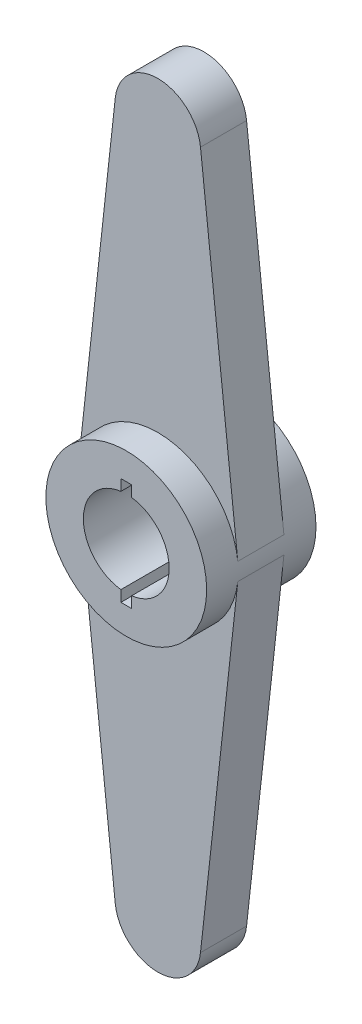
ISO-10303-21;
HEADER;
FILE_DESCRIPTION(('STEP AP214'),'2;1');
FILE_NAME('part.step','',(''),(''),'','','');
FILE_SCHEMA(('AUTOMOTIVE_DESIGN { 1 0 10303 214 1 1 1 1 }'));
ENDSEC;
DATA;
#1=APPLICATION_CONTEXT('core data for automotive mechanical design processes');
#2=APPLICATION_PROTOCOL_DEFINITION('international standard','automotive_design',2000,#1);
#3=PRODUCT_CONTEXT('',#1,'mechanical');
#4=PRODUCT('Part','Part','',(#3));
#5=PRODUCT_RELATED_PRODUCT_CATEGORY('part','',(#4));
#6=PRODUCT_DEFINITION_FORMATION('','',#4);
#7=PRODUCT_DEFINITION_CONTEXT('part definition',#1,'design');
#8=PRODUCT_DEFINITION('design','',#6,#7);
#9=PRODUCT_DEFINITION_SHAPE('','',#8);
#10=(LENGTH_UNIT() NAMED_UNIT(*) SI_UNIT(.MILLI.,.METRE.));
#11=(NAMED_UNIT(*) PLANE_ANGLE_UNIT() SI_UNIT($,.RADIAN.));
#12=(NAMED_UNIT(*) SI_UNIT($,.STERADIAN.) SOLID_ANGLE_UNIT());
#13=UNCERTAINTY_MEASURE_WITH_UNIT(LENGTH_MEASURE(1.E-05),#10,'distance_accuracy_value','');
#14=(GEOMETRIC_REPRESENTATION_CONTEXT(3) GLOBAL_UNCERTAINTY_ASSIGNED_CONTEXT((#13)) GLOBAL_UNIT_ASSIGNED_CONTEXT((#10,
#11,#12)) REPRESENTATION_CONTEXT('',''));
#15=CARTESIAN_POINT('',(0.,0.,0.));
#16=DIRECTION('',(0.,0.,1.));
#17=DIRECTION('',(1.,0.,0.));
#18=AXIS2_PLACEMENT_3D('',#15,#16,#17);
#19=CARTESIAN_POINT('',(0.,0.,2.55));
#20=DIRECTION('',(0.,0.,-1.));
#21=DIRECTION('',(-1.,0.,0.));
#22=AXIS2_PLACEMENT_3D('',#19,#20,#21);
#23=CYLINDRICAL_SURFACE('',#22,2.);
#24=CARTESIAN_POINT('',(0.,0.,-2.55));
#25=DIRECTION('',(0.,0.,1.));
#26=DIRECTION('',(1.,0.,0.));
#27=AXIS2_PLACEMENT_3D('',#24,#25,#26);
#28=CIRCLE('',#27,2.);
#29=CARTESIAN_POINT('',(-0.25,1.98431348329844,-2.55));
#30=VERTEX_POINT('',#29);
#31=CARTESIAN_POINT('',(-0.25,-1.98431348329844,-2.55));
#32=VERTEX_POINT('',#31);
#33=EDGE_CURVE('E214',#30,#32,#28,.T.);
#34=ORIENTED_EDGE('',*,*,#33,.F.);
#35=DIRECTION('',(0.,0.,-1.));
#36=VECTOR('',#35,1.);
#37=CARTESIAN_POINT('',(-0.25,1.98431348329844,2.55));
#38=LINE('',#37,#36);
#39=CARTESIAN_POINT('',(-0.25,1.98431348329844,2.55));
#40=VERTEX_POINT('',#39);
#41=EDGE_CURVE('E11',#40,#30,#38,.T.);
#42=ORIENTED_EDGE('',*,*,#41,.F.);
#43=CARTESIAN_POINT('',(0.,0.,2.55));
#44=DIRECTION('',(0.,0.,1.));
#45=DIRECTION('',(1.,0.,0.));
#46=AXIS2_PLACEMENT_3D('',#43,#44,#45);
#47=CIRCLE('',#46,2.);
#48=CARTESIAN_POINT('',(-0.25,-1.98431348329844,2.55));
#49=VERTEX_POINT('',#48);
#50=EDGE_CURVE('E215',#40,#49,#47,.T.);
#51=ORIENTED_EDGE('',*,*,#50,.T.);
#52=DIRECTION('',(0.,0.,-1.));
#53=VECTOR('',#52,1.);
#54=CARTESIAN_POINT('',(-0.25,-1.98431348329844,2.55));
#55=LINE('',#54,#53);
#56=EDGE_CURVE('E235',#49,#32,#55,.T.);
#57=ORIENTED_EDGE('',*,*,#56,.T.);
#58=EDGE_LOOP('',(#34,#42,#51,#57));
#59=FACE_BOUND('',#58,.T.);
#60=ADVANCED_FACE('F34',(#59),#23,.F.);
#61=CARTESIAN_POINT('',(-0.25,0.,2.55));
#62=DIRECTION('',(-1.,0.,0.));
#63=DIRECTION('',(0.,0.,1.));
#64=AXIS2_PLACEMENT_3D('',#61,#62,#63);
#65=PLANE('',#64);
#66=DIRECTION('',(0.,1.,0.));
#67=VECTOR('',#66,1.);
#68=CARTESIAN_POINT('',(-0.25,0.,-2.55));
#69=LINE('',#68,#67);
#70=CARTESIAN_POINT('',(-0.25,2.5,-2.55));
#71=VERTEX_POINT('',#70);
#72=EDGE_CURVE('E238',#30,#71,#69,.T.);
#73=ORIENTED_EDGE('',*,*,#72,.T.);
#74=DIRECTION('',(0.,0.,-1.));
#75=VECTOR('',#74,1.);
#76=CARTESIAN_POINT('',(-0.25,2.5,2.55));
#77=LINE('',#76,#75);
#78=CARTESIAN_POINT('',(-0.25,2.5,2.55));
#79=VERTEX_POINT('',#78);
#80=EDGE_CURVE('E42',#79,#71,#77,.T.);
#81=ORIENTED_EDGE('',*,*,#80,.F.);
#82=DIRECTION('',(0.,1.,0.));
#83=VECTOR('',#82,1.);
#84=CARTESIAN_POINT('',(-0.25,0.,2.55));
#85=LINE('',#84,#83);
#86=EDGE_CURVE('E218',#40,#79,#85,.T.);
#87=ORIENTED_EDGE('',*,*,#86,.F.);
#88=ORIENTED_EDGE('',*,*,#41,.T.);
#89=EDGE_LOOP('',(#73,#81,#87,#88));
#90=FACE_BOUND('',#89,.T.);
#91=ADVANCED_FACE('F272',(#90),#65,.F.);
#92=CARTESIAN_POINT('',(0.,2.5,2.55));
#93=DIRECTION('',(0.,-1.,0.));
#94=DIRECTION('',(0.,0.,-1.));
#95=AXIS2_PLACEMENT_3D('',#92,#93,#94);
#96=PLANE('',#95);
#97=DIRECTION('',(-1.,0.,0.));
#98=VECTOR('',#97,1.);
#99=CARTESIAN_POINT('',(0.,2.5,-2.55));
#100=LINE('',#99,#98);
#101=CARTESIAN_POINT('',(0.25,2.5,-2.55));
#102=VERTEX_POINT('',#101);
#103=EDGE_CURVE('E242',#102,#71,#100,.T.);
#104=ORIENTED_EDGE('',*,*,#103,.F.);
#105=DIRECTION('',(0.,0.,-1.));
#106=VECTOR('',#105,1.);
#107=CARTESIAN_POINT('',(0.25,2.5,2.55));
#108=LINE('',#107,#106);
#109=CARTESIAN_POINT('',(0.25,2.5,2.55));
#110=VERTEX_POINT('',#109);
#111=EDGE_CURVE('E264',#110,#102,#108,.T.);
#112=ORIENTED_EDGE('',*,*,#111,.F.);
#113=DIRECTION('',(-1.,0.,0.));
#114=VECTOR('',#113,1.);
#115=CARTESIAN_POINT('',(0.,2.5,2.55));
#116=LINE('',#115,#114);
#117=EDGE_CURVE('E222',#110,#79,#116,.T.);
#118=ORIENTED_EDGE('',*,*,#117,.T.);
#119=ORIENTED_EDGE('',*,*,#80,.T.);
#120=EDGE_LOOP('',(#104,#112,#118,#119));
#121=FACE_BOUND('',#120,.T.);
#122=ADVANCED_FACE('F36',(#121),#96,.T.);
#123=CARTESIAN_POINT('',(0.25,0.,2.55));
#124=DIRECTION('',(-1.,0.,0.));
#125=DIRECTION('',(0.,0.,1.));
#126=AXIS2_PLACEMENT_3D('',#123,#124,#125);
#127=PLANE('',#126);
#128=DIRECTION('',(0.,1.,0.));
#129=VECTOR('',#128,1.);
#130=CARTESIAN_POINT('',(0.25,0.,-2.55));
#131=LINE('',#130,#129);
#132=CARTESIAN_POINT('',(0.25,1.98431348329844,-2.55));
#133=VERTEX_POINT('',#132);
#134=EDGE_CURVE('E246',#133,#102,#131,.T.);
#135=ORIENTED_EDGE('',*,*,#134,.F.);
#136=DIRECTION('',(0.,0.,-1.));
#137=VECTOR('',#136,1.);
#138=CARTESIAN_POINT('',(0.25,1.98431348329844,2.55));
#139=LINE('',#138,#137);
#140=CARTESIAN_POINT('',(0.25,1.98431348329844,2.55));
#141=VERTEX_POINT('',#140);
#142=EDGE_CURVE('E262',#141,#133,#139,.T.);
#143=ORIENTED_EDGE('',*,*,#142,.F.);
#144=DIRECTION('',(0.,1.,0.));
#145=VECTOR('',#144,1.);
#146=CARTESIAN_POINT('',(0.25,0.,2.55));
#147=LINE('',#146,#145);
#148=EDGE_CURVE('E226',#141,#110,#147,.T.);
#149=ORIENTED_EDGE('',*,*,#148,.T.);
#150=ORIENTED_EDGE('',*,*,#111,.T.);
#151=EDGE_LOOP('',(#135,#143,#149,#150));
#152=FACE_BOUND('',#151,.T.);
#153=ADVANCED_FACE('F282',(#152),#127,.T.);
#154=CARTESIAN_POINT('',(0.25,-1.98431348329844,-2.55));
#155=VERTEX_POINT('',#154);
#156=EDGE_CURVE('E239',#155,#133,#28,.T.);
#157=ORIENTED_EDGE('',*,*,#156,.F.);
#158=DIRECTION('',(0.,0.,-1.));
#159=VECTOR('',#158,1.);
#160=CARTESIAN_POINT('',(0.25,-1.98431348329844,2.55));
#161=LINE('',#160,#159);
#162=CARTESIAN_POINT('',(0.25,-1.98431348329844,2.55));
#163=VERTEX_POINT('',#162);
#164=EDGE_CURVE('E260',#163,#155,#161,.T.);
#165=ORIENTED_EDGE('',*,*,#164,.F.);
#166=EDGE_CURVE('E220',#163,#141,#47,.T.);
#167=ORIENTED_EDGE('',*,*,#166,.T.);
#168=ORIENTED_EDGE('',*,*,#142,.T.);
#169=EDGE_LOOP('',(#157,#165,#167,#168));
#170=FACE_BOUND('',#169,.T.);
#171=ADVANCED_FACE('F308',(#170),#23,.F.);
#172=CARTESIAN_POINT('',(0.25,-2.5,-2.55));
#173=VERTEX_POINT('',#172);
#174=EDGE_CURVE('E249',#173,#155,#131,.T.);
#175=ORIENTED_EDGE('',*,*,#174,.F.);
#176=DIRECTION('',(0.,0.,-1.));
#177=VECTOR('',#176,1.);
#178=CARTESIAN_POINT('',(0.25,-2.5,2.55));
#179=LINE('',#178,#177);
#180=CARTESIAN_POINT('',(0.25,-2.5,2.55));
#181=VERTEX_POINT('',#180);
#182=EDGE_CURVE('E258',#181,#173,#179,.T.);
#183=ORIENTED_EDGE('',*,*,#182,.F.);
#184=EDGE_CURVE('E229',#181,#163,#147,.T.);
#185=ORIENTED_EDGE('',*,*,#184,.T.);
#186=ORIENTED_EDGE('',*,*,#164,.T.);
#187=EDGE_LOOP('',(#175,#183,#185,#186));
#188=FACE_BOUND('',#187,.T.);
#189=ADVANCED_FACE('F306',(#188),#127,.T.);
#190=CARTESIAN_POINT('',(0.,-2.5,2.55));
#191=DIRECTION('',(0.,-1.,0.));
#192=DIRECTION('',(0.,0.,-1.));
#193=AXIS2_PLACEMENT_3D('',#190,#191,#192);
#194=PLANE('',#193);
#195=DIRECTION('',(-1.,0.,0.));
#196=VECTOR('',#195,1.);
#197=CARTESIAN_POINT('',(0.,-2.5,-2.55));
#198=LINE('',#197,#196);
#199=CARTESIAN_POINT('',(-0.25,-2.5,-2.55));
#200=VERTEX_POINT('',#199);
#201=EDGE_CURVE('E250',#173,#200,#198,.T.);
#202=ORIENTED_EDGE('',*,*,#201,.T.);
#203=DIRECTION('',(0.,0.,-1.));
#204=VECTOR('',#203,1.);
#205=CARTESIAN_POINT('',(-0.25,-2.5,2.55));
#206=LINE('',#205,#204);
#207=CARTESIAN_POINT('',(-0.25,-2.5,2.55));
#208=VERTEX_POINT('',#207);
#209=EDGE_CURVE('E255',#208,#200,#206,.T.);
#210=ORIENTED_EDGE('',*,*,#209,.F.);
#211=DIRECTION('',(-1.,0.,0.));
#212=VECTOR('',#211,1.);
#213=CARTESIAN_POINT('',(0.,-2.5,2.55));
#214=LINE('',#213,#212);
#215=EDGE_CURVE('E230',#181,#208,#214,.T.);
#216=ORIENTED_EDGE('',*,*,#215,.F.);
#217=ORIENTED_EDGE('',*,*,#182,.T.);
#218=EDGE_LOOP('',(#202,#210,#216,#217));
#219=FACE_BOUND('',#218,.T.);
#220=ADVANCED_FACE('F302',(#219),#194,.F.);
#221=EDGE_CURVE('E243',#200,#32,#69,.T.);
#222=ORIENTED_EDGE('',*,*,#221,.T.);
#223=ORIENTED_EDGE('',*,*,#56,.F.);
#224=EDGE_CURVE('E223',#208,#49,#85,.T.);
#225=ORIENTED_EDGE('',*,*,#224,.F.);
#226=ORIENTED_EDGE('',*,*,#209,.T.);
#227=EDGE_LOOP('',(#222,#223,#225,#226));
#228=FACE_BOUND('',#227,.T.);
#229=ADVANCED_FACE('F298',(#228),#65,.F.);
#230=CARTESIAN_POINT('',(0.,0.,2.55));
#231=DIRECTION('',(0.,0.,-1.));
#232=DIRECTION('',(-1.,0.,0.));
#233=AXIS2_PLACEMENT_3D('',#230,#231,#232);
#234=CYLINDRICAL_SURFACE('',#233,3.75);
#235=DIRECTION('',(0.,0.,-1.));
#236=VECTOR('',#235,1.);
#237=CARTESIAN_POINT('',(-3.72764246788992,-0.408878504672898,1.075));
#238=LINE('',#237,#236);
#239=CARTESIAN_POINT('',(-3.72764246788992,-0.408878504672898,1.075));
#240=VERTEX_POINT('',#239);
#241=CARTESIAN_POINT('',(-3.72764246788992,-0.408878504672898,-1.075));
#242=VERTEX_POINT('',#241);
#243=EDGE_CURVE('E49',#240,#242,#238,.T.);
#244=ORIENTED_EDGE('',*,*,#243,.F.);
#245=CARTESIAN_POINT('',(0.,0.,1.075));
#246=DIRECTION('',(0.,0.,1.));
#247=DIRECTION('',(1.,0.,0.));
#248=AXIS2_PLACEMENT_3D('',#245,#246,#247);
#249=CIRCLE('',#248,3.75);
#250=CARTESIAN_POINT('',(3.72764246788992,-0.408878504672896,1.075));
#251=VERTEX_POINT('',#250);
#252=EDGE_CURVE('E54',#240,#251,#249,.T.);
#253=ORIENTED_EDGE('',*,*,#252,.T.);
#254=DIRECTION('',(0.,0.,-1.));
#255=VECTOR('',#254,1.);
#256=CARTESIAN_POINT('',(3.72764246788992,-0.408878504672896,1.075));
#257=LINE('',#256,#255);
#258=CARTESIAN_POINT('',(3.72764246788992,-0.408878504672896,-1.075));
#259=VERTEX_POINT('',#258);
#260=EDGE_CURVE('E166',#251,#259,#257,.T.);
#261=ORIENTED_EDGE('',*,*,#260,.T.);
#262=CARTESIAN_POINT('',(0.,0.,-1.075));
#263=DIRECTION('',(0.,0.,1.));
#264=DIRECTION('',(1.,0.,0.));
#265=AXIS2_PLACEMENT_3D('',#262,#263,#264);
#266=CIRCLE('',#265,3.75);
#267=EDGE_CURVE('E170',#242,#259,#266,.T.);
#268=ORIENTED_EDGE('',*,*,#267,.F.);
#269=EDGE_LOOP('',(#244,#253,#261,#268));
#270=FACE_BOUND('',#269,.T.);
#271=DIRECTION('',(0.,0.,-1.));
#272=VECTOR('',#271,1.);
#273=CARTESIAN_POINT('',(3.72764246788992,0.408878504672897,1.075));
#274=LINE('',#273,#272);
#275=CARTESIAN_POINT('',(3.72764246788992,0.408878504672897,1.075));
#276=VERTEX_POINT('',#275);
#277=CARTESIAN_POINT('',(3.72764246788992,0.408878504672897,-1.075));
#278=VERTEX_POINT('',#277);
#279=EDGE_CURVE('E194',#276,#278,#274,.T.);
#280=ORIENTED_EDGE('',*,*,#279,.F.);
#281=CARTESIAN_POINT('',(0.,0.,1.075));
#282=DIRECTION('',(0.,0.,1.));
#283=DIRECTION('',(1.,0.,0.));
#284=AXIS2_PLACEMENT_3D('',#281,#282,#283);
#285=CIRCLE('',#284,3.75);
#286=CARTESIAN_POINT('',(-3.72764246788992,0.408878504672897,1.075));
#287=VERTEX_POINT('',#286);
#288=EDGE_CURVE('E192',#276,#287,#285,.T.);
#289=ORIENTED_EDGE('',*,*,#288,.T.);
#290=DIRECTION('',(0.,0.,-1.));
#291=VECTOR('',#290,1.);
#292=CARTESIAN_POINT('',(-3.72764246788992,0.408878504672897,1.075));
#293=LINE('',#292,#291);
#294=CARTESIAN_POINT('',(-3.72764246788992,0.408878504672897,-1.075));
#295=VERTEX_POINT('',#294);
#296=EDGE_CURVE('E207',#287,#295,#293,.T.);
#297=ORIENTED_EDGE('',*,*,#296,.T.);
#298=CARTESIAN_POINT('',(0.,0.,-1.075));
#299=DIRECTION('',(0.,0.,1.));
#300=DIRECTION('',(1.,0.,0.));
#301=AXIS2_PLACEMENT_3D('',#298,#299,#300);
#302=CIRCLE('',#301,3.75);
#303=EDGE_CURVE('E187',#278,#295,#302,.T.);
#304=ORIENTED_EDGE('',*,*,#303,.F.);
#305=EDGE_LOOP('',(#280,#289,#297,#304));
#306=FACE_BOUND('',#305,.T.);
#307=CARTESIAN_POINT('',(0.,0.,2.55));
#308=DIRECTION('',(0.,0.,1.));
#309=DIRECTION('',(1.,0.,0.));
#310=AXIS2_PLACEMENT_3D('',#307,#308,#309);
#311=CIRCLE('',#310,3.75);
#312=CARTESIAN_POINT('',(3.75,0.,2.55));
#313=VERTEX_POINT('',#312);
#314=EDGE_CURVE('E232',#313,#313,#311,.T.);
#315=ORIENTED_EDGE('',*,*,#314,.F.);
#316=EDGE_LOOP('',(#315));
#317=FACE_BOUND('',#316,.T.);
#318=CARTESIAN_POINT('',(0.,0.,-2.55));
#319=DIRECTION('',(0.,0.,1.));
#320=DIRECTION('',(1.,0.,0.));
#321=AXIS2_PLACEMENT_3D('',#318,#319,#320);
#322=CIRCLE('',#321,3.75);
#323=CARTESIAN_POINT('',(3.75,0.,-2.55));
#324=VERTEX_POINT('',#323);
#325=EDGE_CURVE('E219',#324,#324,#322,.T.);
#326=ORIENTED_EDGE('',*,*,#325,.T.);
#327=EDGE_LOOP('',(#326));
#328=FACE_BOUND('',#327,.T.);
#329=ADVANCED_FACE('F326',(#270,#306,#317,#328),#234,.T.);
#330=CARTESIAN_POINT('',(0.,0.,2.55));
#331=DIRECTION('',(0.,0.,1.));
#332=DIRECTION('',(1.,0.,0.));
#333=AXIS2_PLACEMENT_3D('',#330,#331,#332);
#334=PLANE('',#333);
#335=ORIENTED_EDGE('',*,*,#50,.F.);
#336=ORIENTED_EDGE('',*,*,#86,.T.);
#337=ORIENTED_EDGE('',*,*,#117,.F.);
#338=ORIENTED_EDGE('',*,*,#148,.F.);
#339=ORIENTED_EDGE('',*,*,#166,.F.);
#340=ORIENTED_EDGE('',*,*,#184,.F.);
#341=ORIENTED_EDGE('',*,*,#215,.T.);
#342=ORIENTED_EDGE('',*,*,#224,.T.);
#343=EDGE_LOOP('',(#335,#336,#337,#338,#339,#340,#341,#342));
#344=FACE_BOUND('',#343,.T.);
#345=ORIENTED_EDGE('',*,*,#314,.T.);
#346=EDGE_LOOP('',(#345));
#347=FACE_BOUND('',#346,.T.);
#348=ADVANCED_FACE('F286',(#344,#347),#334,.T.);
#349=CARTESIAN_POINT('',(0.,0.,-2.55));
#350=DIRECTION('',(0.,0.,1.));
#351=DIRECTION('',(1.,0.,0.));
#352=AXIS2_PLACEMENT_3D('',#349,#350,#351);
#353=PLANE('',#352);
#354=ORIENTED_EDGE('',*,*,#33,.T.);
#355=ORIENTED_EDGE('',*,*,#221,.F.);
#356=ORIENTED_EDGE('',*,*,#201,.F.);
#357=ORIENTED_EDGE('',*,*,#174,.T.);
#358=ORIENTED_EDGE('',*,*,#156,.T.);
#359=ORIENTED_EDGE('',*,*,#134,.T.);
#360=ORIENTED_EDGE('',*,*,#103,.T.);
#361=ORIENTED_EDGE('',*,*,#72,.F.);
#362=EDGE_LOOP('',(#354,#355,#356,#357,#358,#359,#360,#361));
#363=FACE_BOUND('',#362,.T.);
#364=ORIENTED_EDGE('',*,*,#325,.F.);
#365=EDGE_LOOP('',(#364));
#366=FACE_BOUND('',#365,.T.);
#367=ADVANCED_FACE('F275',(#363,#366),#353,.F.);
#368=CARTESIAN_POINT('',(3.72764246788992,0.408878504672897,1.075));
#369=DIRECTION('',(-0.994037991437312,-0.109034267912773,0.));
#370=DIRECTION('',(0.109034267912773,-0.994037991437312,0.));
#371=AXIS2_PLACEMENT_3D('',#368,#369,#370);
#372=PLANE('',#371);
#373=DIRECTION('',(-0.109034267912773,0.994037991437312,0.));
#374=VECTOR('',#373,1.);
#375=CARTESIAN_POINT('',(3.72764246788992,0.408878504672897,-1.075));
#376=LINE('',#375,#374);
#377=CARTESIAN_POINT('',(1.98807598287462,16.2680685358255,-1.075));
#378=VERTEX_POINT('',#377);
#379=EDGE_CURVE('E182',#278,#378,#376,.T.);
#380=ORIENTED_EDGE('',*,*,#379,.T.);
#381=DIRECTION('',(0.,0.,-1.));
#382=VECTOR('',#381,1.);
#383=CARTESIAN_POINT('',(1.98807598287462,16.2680685358255,1.075));
#384=LINE('',#383,#382);
#385=CARTESIAN_POINT('',(1.98807598287462,16.2680685358255,1.075));
#386=VERTEX_POINT('',#385);
#387=EDGE_CURVE('E211',#386,#378,#384,.T.);
#388=ORIENTED_EDGE('',*,*,#387,.F.);
#389=DIRECTION('',(-0.109034267912773,0.994037991437312,0.));
#390=VECTOR('',#389,1.);
#391=CARTESIAN_POINT('',(3.72764246788992,0.408878504672897,1.075));
#392=LINE('',#391,#390);
#393=EDGE_CURVE('E183',#276,#386,#392,.T.);
#394=ORIENTED_EDGE('',*,*,#393,.F.);
#395=ORIENTED_EDGE('',*,*,#279,.T.);
#396=EDGE_LOOP('',(#380,#388,#394,#395));
#397=FACE_BOUND('',#396,.T.);
#398=ADVANCED_FACE('F390',(#397),#372,.F.);
#399=CARTESIAN_POINT('',(0.,16.05,1.075));
#400=DIRECTION('',(0.,0.,-1.));
#401=DIRECTION('',(-1.,0.,0.));
#402=AXIS2_PLACEMENT_3D('',#399,#400,#401);
#403=CYLINDRICAL_SURFACE('',#402,2.);
#404=CARTESIAN_POINT('',(0.,16.05,-1.075));
#405=DIRECTION('',(0.,0.,1.));
#406=DIRECTION('',(1.,0.,0.));
#407=AXIS2_PLACEMENT_3D('',#404,#405,#406);
#408=CIRCLE('',#407,2.);
#409=CARTESIAN_POINT('',(-1.98807598287462,16.2680685358255,-1.075));
#410=VERTEX_POINT('',#409);
#411=EDGE_CURVE('E197',#378,#410,#408,.T.);
#412=ORIENTED_EDGE('',*,*,#411,.T.);
#413=DIRECTION('',(0.,0.,-1.));
#414=VECTOR('',#413,1.);
#415=CARTESIAN_POINT('',(-1.98807598287462,16.2680685358255,1.075));
#416=LINE('',#415,#414);
#417=CARTESIAN_POINT('',(-1.98807598287462,16.2680685358255,1.075));
#418=VERTEX_POINT('',#417);
#419=EDGE_CURVE('E209',#418,#410,#416,.T.);
#420=ORIENTED_EDGE('',*,*,#419,.F.);
#421=CARTESIAN_POINT('',(0.,16.05,1.075));
#422=DIRECTION('',(0.,0.,1.));
#423=DIRECTION('',(1.,0.,0.));
#424=AXIS2_PLACEMENT_3D('',#421,#422,#423);
#425=CIRCLE('',#424,2.);
#426=EDGE_CURVE('E186',#386,#418,#425,.T.);
#427=ORIENTED_EDGE('',*,*,#426,.F.);
#428=ORIENTED_EDGE('',*,*,#387,.T.);
#429=EDGE_LOOP('',(#412,#420,#427,#428));
#430=FACE_BOUND('',#429,.T.);
#431=ADVANCED_FACE('F397',(#430),#403,.T.);
#432=CARTESIAN_POINT('',(-3.72764246788992,0.408878504672897,1.075));
#433=DIRECTION('',(-0.994037991437312,0.109034267912773,0.));
#434=DIRECTION('',(-0.109034267912773,-0.994037991437312,0.));
#435=AXIS2_PLACEMENT_3D('',#432,#433,#434);
#436=PLANE('',#435);
#437=DIRECTION('',(0.109034267912773,0.994037991437312,0.));
#438=VECTOR('',#437,1.);
#439=CARTESIAN_POINT('',(-3.72764246788992,0.408878504672897,-1.075));
#440=LINE('',#439,#438);
#441=EDGE_CURVE('E200',#295,#410,#440,.T.);
#442=ORIENTED_EDGE('',*,*,#441,.F.);
#443=ORIENTED_EDGE('',*,*,#296,.F.);
#444=DIRECTION('',(0.109034267912773,0.994037991437312,0.));
#445=VECTOR('',#444,1.);
#446=CARTESIAN_POINT('',(-3.72764246788992,0.408878504672897,1.075));
#447=LINE('',#446,#445);
#448=EDGE_CURVE('E189',#287,#418,#447,.T.);
#449=ORIENTED_EDGE('',*,*,#448,.T.);
#450=ORIENTED_EDGE('',*,*,#419,.T.);
#451=EDGE_LOOP('',(#442,#443,#449,#450));
#452=FACE_BOUND('',#451,.T.);
#453=ADVANCED_FACE('F406',(#452),#436,.T.);
#454=CARTESIAN_POINT('',(0.,0.,1.075));
#455=DIRECTION('',(0.,0.,1.));
#456=DIRECTION('',(1.,0.,0.));
#457=AXIS2_PLACEMENT_3D('',#454,#455,#456);
#458=PLANE('',#457);
#459=ORIENTED_EDGE('',*,*,#393,.T.);
#460=ORIENTED_EDGE('',*,*,#426,.T.);
#461=ORIENTED_EDGE('',*,*,#448,.F.);
#462=ORIENTED_EDGE('',*,*,#288,.F.);
#463=EDGE_LOOP('',(#459,#460,#461,#462));
#464=FACE_BOUND('',#463,.T.);
#465=ADVANCED_FACE('F415',(#464),#458,.T.);
#466=CARTESIAN_POINT('',(0.,0.,-1.075));
#467=DIRECTION('',(0.,0.,1.));
#468=DIRECTION('',(1.,0.,0.));
#469=AXIS2_PLACEMENT_3D('',#466,#467,#468);
#470=PLANE('',#469);
#471=ORIENTED_EDGE('',*,*,#379,.F.);
#472=ORIENTED_EDGE('',*,*,#303,.T.);
#473=ORIENTED_EDGE('',*,*,#441,.T.);
#474=ORIENTED_EDGE('',*,*,#411,.F.);
#475=EDGE_LOOP('',(#471,#472,#473,#474));
#476=FACE_BOUND('',#475,.T.);
#477=ADVANCED_FACE('F424',(#476),#470,.F.);
#478=CARTESIAN_POINT('',(-3.72764246788992,-0.408878504672898,1.075));
#479=DIRECTION('',(0.994037991437312,0.109034267912773,0.));
#480=DIRECTION('',(-0.109034267912773,0.994037991437312,0.));
#481=AXIS2_PLACEMENT_3D('',#478,#479,#480);
#482=PLANE('',#481);
#483=DIRECTION('',(0.109034267912773,-0.994037991437312,0.));
#484=VECTOR('',#483,1.);
#485=CARTESIAN_POINT('',(-3.72764246788992,-0.408878504672898,-1.075));
#486=LINE('',#485,#484);
#487=CARTESIAN_POINT('',(-1.98807598287462,-16.2680685358255,-1.075));
#488=VERTEX_POINT('',#487);
#489=EDGE_CURVE('E156',#242,#488,#486,.T.);
#490=ORIENTED_EDGE('',*,*,#489,.T.);
#491=DIRECTION('',(0.,0.,-1.));
#492=VECTOR('',#491,1.);
#493=CARTESIAN_POINT('',(-1.98807598287462,-16.2680685358255,1.075));
#494=LINE('',#493,#492);
#495=CARTESIAN_POINT('',(-1.98807598287462,-16.2680685358255,1.075));
#496=VERTEX_POINT('',#495);
#497=EDGE_CURVE('E153',#496,#488,#494,.T.);
#498=ORIENTED_EDGE('',*,*,#497,.F.);
#499=DIRECTION('',(0.109034267912773,-0.994037991437312,0.));
#500=VECTOR('',#499,1.);
#501=CARTESIAN_POINT('',(-3.72764246788992,-0.408878504672898,1.075));
#502=LINE('',#501,#500);
#503=EDGE_CURVE('E143',#240,#496,#502,.T.);
#504=ORIENTED_EDGE('',*,*,#503,.F.);
#505=ORIENTED_EDGE('',*,*,#243,.T.);
#506=EDGE_LOOP('',(#490,#498,#504,#505));
#507=FACE_BOUND('',#506,.T.);
#508=ADVANCED_FACE('F154',(#507),#482,.F.);
#509=CARTESIAN_POINT('',(0.,-16.05,1.075));
#510=DIRECTION('',(0.,0.,-1.));
#511=DIRECTION('',(-1.,0.,0.));
#512=AXIS2_PLACEMENT_3D('',#509,#510,#511);
#513=CYLINDRICAL_SURFACE('',#512,2.);
#514=CARTESIAN_POINT('',(0.,-16.05,-1.075));
#515=DIRECTION('',(0.,0.,1.));
#516=DIRECTION('',(1.,0.,0.));
#517=AXIS2_PLACEMENT_3D('',#514,#515,#516);
#518=CIRCLE('',#517,2.);
#519=CARTESIAN_POINT('',(1.98807598287463,-16.2680685358255,-1.075));
#520=VERTEX_POINT('',#519);
#521=EDGE_CURVE('E174',#488,#520,#518,.T.);
#522=ORIENTED_EDGE('',*,*,#521,.T.);
#523=DIRECTION('',(0.,0.,-1.));
#524=VECTOR('',#523,1.);
#525=CARTESIAN_POINT('',(1.98807598287463,-16.2680685358255,1.075));
#526=LINE('',#525,#524);
#527=CARTESIAN_POINT('',(1.98807598287463,-16.2680685358255,1.075));
#528=VERTEX_POINT('',#527);
#529=EDGE_CURVE('E160',#528,#520,#526,.T.);
#530=ORIENTED_EDGE('',*,*,#529,.F.);
#531=CARTESIAN_POINT('',(0.,-16.05,1.075));
#532=DIRECTION('',(0.,0.,1.));
#533=DIRECTION('',(1.,0.,0.));
#534=AXIS2_PLACEMENT_3D('',#531,#532,#533);
#535=CIRCLE('',#534,2.);
#536=EDGE_CURVE('E148',#496,#528,#535,.T.);
#537=ORIENTED_EDGE('',*,*,#536,.F.);
#538=ORIENTED_EDGE('',*,*,#497,.T.);
#539=EDGE_LOOP('',(#522,#530,#537,#538));
#540=FACE_BOUND('',#539,.T.);
#541=ADVANCED_FACE('F162',(#540),#513,.T.);
#542=CARTESIAN_POINT('',(3.72764246788992,-0.408878504672896,1.075));
#543=DIRECTION('',(0.994037991437312,-0.109034267912772,0.));
#544=DIRECTION('',(0.109034267912772,0.994037991437312,0.));
#545=AXIS2_PLACEMENT_3D('',#542,#543,#544);
#546=PLANE('',#545);
#547=DIRECTION('',(-0.109034267912772,-0.994037991437312,0.));
#548=VECTOR('',#547,1.);
#549=CARTESIAN_POINT('',(3.72764246788992,-0.408878504672896,-1.075));
#550=LINE('',#549,#548);
#551=EDGE_CURVE('E176',#259,#520,#550,.T.);
#552=ORIENTED_EDGE('',*,*,#551,.F.);
#553=ORIENTED_EDGE('',*,*,#260,.F.);
#554=DIRECTION('',(-0.109034267912772,-0.994037991437312,0.));
#555=VECTOR('',#554,1.);
#556=CARTESIAN_POINT('',(3.72764246788992,-0.408878504672896,1.075));
#557=LINE('',#556,#555);
#558=EDGE_CURVE('E164',#251,#528,#557,.T.);
#559=ORIENTED_EDGE('',*,*,#558,.T.);
#560=ORIENTED_EDGE('',*,*,#529,.T.);
#561=EDGE_LOOP('',(#552,#553,#559,#560));
#562=FACE_BOUND('',#561,.T.);
#563=ADVANCED_FACE('F448',(#562),#546,.T.);
#564=CARTESIAN_POINT('',(0.,0.,1.075));
#565=DIRECTION('',(0.,0.,1.));
#566=DIRECTION('',(1.,0.,0.));
#567=AXIS2_PLACEMENT_3D('',#564,#565,#566);
#568=PLANE('',#567);
#569=ORIENTED_EDGE('',*,*,#252,.F.);
#570=ORIENTED_EDGE('',*,*,#503,.T.);
#571=ORIENTED_EDGE('',*,*,#536,.T.);
#572=ORIENTED_EDGE('',*,*,#558,.F.);
#573=EDGE_LOOP('',(#569,#570,#571,#572));
#574=FACE_BOUND('',#573,.T.);
#575=ADVANCED_FACE('F145',(#574),#568,.T.);
#576=CARTESIAN_POINT('',(0.,0.,-1.075));
#577=DIRECTION('',(0.,0.,1.));
#578=DIRECTION('',(1.,0.,0.));
#579=AXIS2_PLACEMENT_3D('',#576,#577,#578);
#580=PLANE('',#579);
#581=ORIENTED_EDGE('',*,*,#267,.T.);
#582=ORIENTED_EDGE('',*,*,#551,.T.);
#583=ORIENTED_EDGE('',*,*,#521,.F.);
#584=ORIENTED_EDGE('',*,*,#489,.F.);
#585=EDGE_LOOP('',(#581,#582,#583,#584));
#586=FACE_BOUND('',#585,.T.);
#587=ADVANCED_FACE('F464',(#586),#580,.F.);
#588=CLOSED_SHELL('',(#60,#91,#122,#153,#171,#189,#220,#229,#329,#348,#367,#398,#431,#453,#465,
#477,#508,#541,#563,#575,#587));
#589=MANIFOLD_SOLID_BREP('B2',#588);
#590=ADVANCED_BREP_SHAPE_REPRESENTATION('',(#18,#589),#14);
#591=SHAPE_DEFINITION_REPRESENTATION(#9,#590);
ENDSEC;
END-ISO-10303-21;
